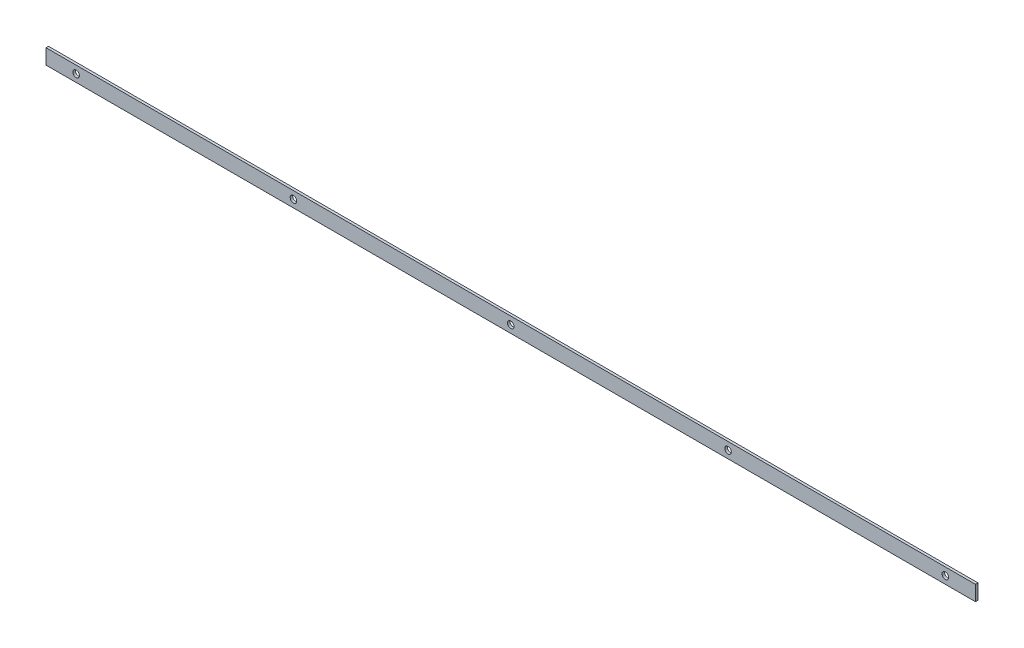
ISO-10303-21;
HEADER;
FILE_DESCRIPTION(('STEP AP214'),'2;1');
FILE_NAME('part.step','',(''),(''),'','','');
FILE_SCHEMA(('AUTOMOTIVE_DESIGN { 1 0 10303 214 1 1 1 1 }'));
ENDSEC;
DATA;
#1=APPLICATION_CONTEXT('core data for automotive mechanical design processes');
#2=APPLICATION_PROTOCOL_DEFINITION('international standard','automotive_design',2000,#1);
#3=PRODUCT_CONTEXT('',#1,'mechanical');
#4=PRODUCT('Part','Part','',(#3));
#5=PRODUCT_RELATED_PRODUCT_CATEGORY('part','',(#4));
#6=PRODUCT_DEFINITION_FORMATION('','',#4);
#7=PRODUCT_DEFINITION_CONTEXT('part definition',#1,'design');
#8=PRODUCT_DEFINITION('design','',#6,#7);
#9=PRODUCT_DEFINITION_SHAPE('','',#8);
#10=(LENGTH_UNIT() NAMED_UNIT(*) SI_UNIT(.MILLI.,.METRE.));
#11=(NAMED_UNIT(*) PLANE_ANGLE_UNIT() SI_UNIT($,.RADIAN.));
#12=(NAMED_UNIT(*) SI_UNIT($,.STERADIAN.) SOLID_ANGLE_UNIT());
#13=UNCERTAINTY_MEASURE_WITH_UNIT(LENGTH_MEASURE(1.E-05),#10,'distance_accuracy_value','');
#14=(GEOMETRIC_REPRESENTATION_CONTEXT(3) GLOBAL_UNCERTAINTY_ASSIGNED_CONTEXT((#13)) GLOBAL_UNIT_ASSIGNED_CONTEXT((#10,
#11,#12)) REPRESENTATION_CONTEXT('',''));
#15=CARTESIAN_POINT('',(0.,0.,0.));
#16=DIRECTION('',(0.,0.,1.));
#17=DIRECTION('',(1.,0.,0.));
#18=AXIS2_PLACEMENT_3D('',#15,#16,#17);
#19=CARTESIAN_POINT('',(865.,0.,-2.5));
#20=DIRECTION('',(0.,0.,-1.));
#21=DIRECTION('',(-1.,0.,0.));
#22=AXIS2_PLACEMENT_3D('',#19,#20,#21);
#23=CYLINDRICAL_SURFACE('',#22,6.49999999999995);
#24=CARTESIAN_POINT('',(865.,0.,2.5));
#25=DIRECTION('',(0.,0.,-1.));
#26=DIRECTION('',(-1.,0.,0.));
#27=AXIS2_PLACEMENT_3D('',#24,#25,#26);
#28=CIRCLE('',#27,6.49999999999995);
#29=CARTESIAN_POINT('',(858.5,0.,2.5));
#30=VERTEX_POINT('',#29);
#31=EDGE_CURVE('E57',#30,#30,#28,.T.);
#32=ORIENTED_EDGE('',*,*,#31,.F.);
#33=EDGE_LOOP('',(#32));
#34=FACE_BOUND('',#33,.T.);
#35=CARTESIAN_POINT('',(865.,0.,-2.5));
#36=DIRECTION('',(0.,0.,-1.));
#37=DIRECTION('',(-1.,0.,0.));
#38=AXIS2_PLACEMENT_3D('',#35,#36,#37);
#39=CIRCLE('',#38,6.49999999999995);
#40=CARTESIAN_POINT('',(858.5,0.,-2.5));
#41=VERTEX_POINT('',#40);
#42=EDGE_CURVE('E12',#41,#41,#39,.T.);
#43=ORIENTED_EDGE('',*,*,#42,.T.);
#44=EDGE_LOOP('',(#43));
#45=FACE_BOUND('',#44,.T.);
#46=ADVANCED_FACE('F49',(#34,#45),#23,.F.);
#47=CARTESIAN_POINT('',(432.5,0.,-2.5));
#48=DIRECTION('',(0.,0.,-1.));
#49=DIRECTION('',(-1.,0.,0.));
#50=AXIS2_PLACEMENT_3D('',#47,#48,#49);
#51=CYLINDRICAL_SURFACE('',#50,6.49999999999995);
#52=CARTESIAN_POINT('',(432.5,0.,2.5));
#53=DIRECTION('',(0.,0.,-1.));
#54=DIRECTION('',(-1.,0.,0.));
#55=AXIS2_PLACEMENT_3D('',#52,#53,#54);
#56=CIRCLE('',#55,6.49999999999995);
#57=CARTESIAN_POINT('',(426.,0.,2.5));
#58=VERTEX_POINT('',#57);
#59=EDGE_CURVE('E133',#58,#58,#56,.T.);
#60=ORIENTED_EDGE('',*,*,#59,.F.);
#61=EDGE_LOOP('',(#60));
#62=FACE_BOUND('',#61,.T.);
#63=CARTESIAN_POINT('',(432.5,0.,-2.5));
#64=DIRECTION('',(0.,0.,-1.));
#65=DIRECTION('',(-1.,0.,0.));
#66=AXIS2_PLACEMENT_3D('',#63,#64,#65);
#67=CIRCLE('',#66,6.49999999999995);
#68=CARTESIAN_POINT('',(426.,0.,-2.5));
#69=VERTEX_POINT('',#68);
#70=EDGE_CURVE('E136',#69,#69,#67,.T.);
#71=ORIENTED_EDGE('',*,*,#70,.T.);
#72=EDGE_LOOP('',(#71));
#73=FACE_BOUND('',#72,.T.);
#74=ADVANCED_FACE('F145',(#62,#73),#51,.F.);
#75=CARTESIAN_POINT('',(0.,0.,-2.5));
#76=DIRECTION('',(0.,0.,-1.));
#77=DIRECTION('',(-1.,0.,0.));
#78=AXIS2_PLACEMENT_3D('',#75,#76,#77);
#79=CYLINDRICAL_SURFACE('',#78,6.49999999999995);
#80=CARTESIAN_POINT('',(0.,0.,2.5));
#81=DIRECTION('',(0.,0.,-1.));
#82=DIRECTION('',(-1.,0.,0.));
#83=AXIS2_PLACEMENT_3D('',#80,#81,#82);
#84=CIRCLE('',#83,6.49999999999995);
#85=CARTESIAN_POINT('',(-6.49999999999995,0.,2.5));
#86=VERTEX_POINT('',#85);
#87=EDGE_CURVE('E127',#86,#86,#84,.T.);
#88=ORIENTED_EDGE('',*,*,#87,.F.);
#89=EDGE_LOOP('',(#88));
#90=FACE_BOUND('',#89,.T.);
#91=CARTESIAN_POINT('',(0.,0.,-2.5));
#92=DIRECTION('',(0.,0.,-1.));
#93=DIRECTION('',(-1.,0.,0.));
#94=AXIS2_PLACEMENT_3D('',#91,#92,#93);
#95=CIRCLE('',#94,6.49999999999995);
#96=CARTESIAN_POINT('',(-6.49999999999995,0.,-2.5));
#97=VERTEX_POINT('',#96);
#98=EDGE_CURVE('E130',#97,#97,#95,.T.);
#99=ORIENTED_EDGE('',*,*,#98,.T.);
#100=EDGE_LOOP('',(#99));
#101=FACE_BOUND('',#100,.T.);
#102=ADVANCED_FACE('F157',(#90,#101),#79,.F.);
#103=CARTESIAN_POINT('',(925.,-15.,2.5));
#104=DIRECTION('',(0.,1.,0.));
#105=DIRECTION('',(0.,0.,1.));
#106=AXIS2_PLACEMENT_3D('',#103,#104,#105);
#107=PLANE('',#106);
#108=DIRECTION('',(0.,0.,-1.));
#109=VECTOR('',#108,1.);
#110=CARTESIAN_POINT('',(-925.,-15.,2.5));
#111=LINE('',#110,#109);
#112=CARTESIAN_POINT('',(-925.,-15.,2.5));
#113=VERTEX_POINT('',#112);
#114=CARTESIAN_POINT('',(-925.,-15.,-2.5));
#115=VERTEX_POINT('',#114);
#116=EDGE_CURVE('E117',#113,#115,#111,.T.);
#117=ORIENTED_EDGE('',*,*,#116,.T.);
#118=DIRECTION('',(-1.,0.,0.));
#119=VECTOR('',#118,1.);
#120=CARTESIAN_POINT('',(925.,-15.,-2.5));
#121=LINE('',#120,#119);
#122=CARTESIAN_POINT('',(925.,-15.,-2.5));
#123=VERTEX_POINT('',#122);
#124=EDGE_CURVE('E108',#123,#115,#121,.T.);
#125=ORIENTED_EDGE('',*,*,#124,.F.);
#126=DIRECTION('',(0.,0.,-1.));
#127=VECTOR('',#126,1.);
#128=CARTESIAN_POINT('',(925.,-15.,2.5));
#129=LINE('',#128,#127);
#130=CARTESIAN_POINT('',(925.,-15.,2.5));
#131=VERTEX_POINT('',#130);
#132=EDGE_CURVE('E101',#131,#123,#129,.T.);
#133=ORIENTED_EDGE('',*,*,#132,.F.);
#134=DIRECTION('',(-1.,0.,0.));
#135=VECTOR('',#134,1.);
#136=CARTESIAN_POINT('',(925.,-15.,2.5));
#137=LINE('',#136,#135);
#138=EDGE_CURVE('E113',#131,#113,#137,.T.);
#139=ORIENTED_EDGE('',*,*,#138,.T.);
#140=EDGE_LOOP('',(#117,#125,#133,#139));
#141=FACE_BOUND('',#140,.T.);
#142=ADVANCED_FACE('F149',(#141),#107,.F.);
#143=CARTESIAN_POINT('',(925.,-15.,-2.5));
#144=DIRECTION('',(0.,0.,1.));
#145=DIRECTION('',(1.,0.,0.));
#146=AXIS2_PLACEMENT_3D('',#143,#144,#145);
#147=PLANE('',#146);
#148=CARTESIAN_POINT('',(-432.5,0.,-2.5));
#149=DIRECTION('',(0.,0.,-1.));
#150=DIRECTION('',(-1.,0.,0.));
#151=AXIS2_PLACEMENT_3D('',#148,#149,#150);
#152=CIRCLE('',#151,6.49999999999995);
#153=CARTESIAN_POINT('',(-439.,0.,-2.5));
#154=VERTEX_POINT('',#153);
#155=EDGE_CURVE('E201',#154,#154,#152,.T.);
#156=ORIENTED_EDGE('',*,*,#155,.F.);
#157=EDGE_LOOP('',(#156));
#158=FACE_BOUND('',#157,.T.);
#159=CARTESIAN_POINT('',(-865.,0.,-2.5));
#160=DIRECTION('',(0.,0.,-1.));
#161=DIRECTION('',(-1.,0.,0.));
#162=AXIS2_PLACEMENT_3D('',#159,#160,#161);
#163=CIRCLE('',#162,6.49999999999995);
#164=CARTESIAN_POINT('',(-871.5,0.,-2.5));
#165=VERTEX_POINT('',#164);
#166=EDGE_CURVE('E202',#165,#165,#163,.T.);
#167=ORIENTED_EDGE('',*,*,#166,.F.);
#168=EDGE_LOOP('',(#167));
#169=FACE_BOUND('',#168,.T.);
#170=DIRECTION('',(0.,1.,0.));
#171=VECTOR('',#170,1.);
#172=CARTESIAN_POINT('',(-925.,-15.,-2.5));
#173=LINE('',#172,#171);
#174=CARTESIAN_POINT('',(-925.,15.,-2.5));
#175=VERTEX_POINT('',#174);
#176=EDGE_CURVE('E107',#115,#175,#173,.T.);
#177=ORIENTED_EDGE('',*,*,#176,.T.);
#178=DIRECTION('',(-1.,0.,0.));
#179=VECTOR('',#178,1.);
#180=CARTESIAN_POINT('',(925.,15.,-2.5));
#181=LINE('',#180,#179);
#182=CARTESIAN_POINT('',(925.,15.,-2.5));
#183=VERTEX_POINT('',#182);
#184=EDGE_CURVE('E104',#183,#175,#181,.T.);
#185=ORIENTED_EDGE('',*,*,#184,.F.);
#186=DIRECTION('',(0.,1.,0.));
#187=VECTOR('',#186,1.);
#188=CARTESIAN_POINT('',(925.,-15.,-2.5));
#189=LINE('',#188,#187);
#190=EDGE_CURVE('E96',#123,#183,#189,.T.);
#191=ORIENTED_EDGE('',*,*,#190,.F.);
#192=ORIENTED_EDGE('',*,*,#124,.T.);
#193=EDGE_LOOP('',(#177,#185,#191,#192));
#194=FACE_BOUND('',#193,.T.);
#195=ORIENTED_EDGE('',*,*,#98,.F.);
#196=EDGE_LOOP('',(#195));
#197=FACE_BOUND('',#196,.T.);
#198=ORIENTED_EDGE('',*,*,#70,.F.);
#199=EDGE_LOOP('',(#198));
#200=FACE_BOUND('',#199,.T.);
#201=ORIENTED_EDGE('',*,*,#42,.F.);
#202=EDGE_LOOP('',(#201));
#203=FACE_BOUND('',#202,.T.);
#204=ADVANCED_FACE('F105',(#158,#169,#194,#197,#200,#203),#147,.F.);
#205=CARTESIAN_POINT('',(925.,15.,2.5));
#206=DIRECTION('',(0.,-1.,0.));
#207=DIRECTION('',(0.,0.,-1.));
#208=AXIS2_PLACEMENT_3D('',#205,#206,#207);
#209=PLANE('',#208);
#210=DIRECTION('',(0.,0.,1.));
#211=VECTOR('',#210,1.);
#212=CARTESIAN_POINT('',(-925.,15.,2.5));
#213=LINE('',#212,#211);
#214=CARTESIAN_POINT('',(-925.,15.,2.5));
#215=VERTEX_POINT('',#214);
#216=EDGE_CURVE('E82',#175,#215,#213,.T.);
#217=ORIENTED_EDGE('',*,*,#216,.T.);
#218=DIRECTION('',(-1.,0.,0.));
#219=VECTOR('',#218,1.);
#220=CARTESIAN_POINT('',(925.,15.,2.5));
#221=LINE('',#220,#219);
#222=CARTESIAN_POINT('',(925.,15.,2.5));
#223=VERTEX_POINT('',#222);
#224=EDGE_CURVE('E109',#223,#215,#221,.T.);
#225=ORIENTED_EDGE('',*,*,#224,.F.);
#226=DIRECTION('',(0.,0.,1.));
#227=VECTOR('',#226,1.);
#228=CARTESIAN_POINT('',(925.,15.,2.5));
#229=LINE('',#228,#227);
#230=EDGE_CURVE('E99',#183,#223,#229,.T.);
#231=ORIENTED_EDGE('',*,*,#230,.F.);
#232=ORIENTED_EDGE('',*,*,#184,.T.);
#233=EDGE_LOOP('',(#217,#225,#231,#232));
#234=FACE_BOUND('',#233,.T.);
#235=ADVANCED_FACE('F111',(#234),#209,.F.);
#236=CARTESIAN_POINT('',(925.,-15.,2.5));
#237=DIRECTION('',(0.,0.,-1.));
#238=DIRECTION('',(-1.,0.,0.));
#239=AXIS2_PLACEMENT_3D('',#236,#237,#238);
#240=PLANE('',#239);
#241=CARTESIAN_POINT('',(-432.5,0.,2.5));
#242=DIRECTION('',(0.,0.,-1.));
#243=DIRECTION('',(-1.,0.,0.));
#244=AXIS2_PLACEMENT_3D('',#241,#242,#243);
#245=CIRCLE('',#244,6.49999999999995);
#246=CARTESIAN_POINT('',(-439.,0.,2.5));
#247=VERTEX_POINT('',#246);
#248=EDGE_CURVE('E199',#247,#247,#245,.T.);
#249=ORIENTED_EDGE('',*,*,#248,.T.);
#250=EDGE_LOOP('',(#249));
#251=FACE_BOUND('',#250,.T.);
#252=CARTESIAN_POINT('',(-865.,0.,2.5));
#253=DIRECTION('',(0.,0.,-1.));
#254=DIRECTION('',(-1.,0.,0.));
#255=AXIS2_PLACEMENT_3D('',#252,#253,#254);
#256=CIRCLE('',#255,6.49999999999995);
#257=CARTESIAN_POINT('',(-871.5,0.,2.5));
#258=VERTEX_POINT('',#257);
#259=EDGE_CURVE('E120',#258,#258,#256,.T.);
#260=ORIENTED_EDGE('',*,*,#259,.T.);
#261=EDGE_LOOP('',(#260));
#262=FACE_BOUND('',#261,.T.);
#263=DIRECTION('',(0.,-1.,0.));
#264=VECTOR('',#263,1.);
#265=CARTESIAN_POINT('',(-925.,-15.,2.5));
#266=LINE('',#265,#264);
#267=EDGE_CURVE('E88',#215,#113,#266,.T.);
#268=ORIENTED_EDGE('',*,*,#267,.T.);
#269=ORIENTED_EDGE('',*,*,#138,.F.);
#270=DIRECTION('',(0.,-1.,0.));
#271=VECTOR('',#270,1.);
#272=CARTESIAN_POINT('',(925.,-15.,2.5));
#273=LINE('',#272,#271);
#274=EDGE_CURVE('E65',#223,#131,#273,.T.);
#275=ORIENTED_EDGE('',*,*,#274,.F.);
#276=ORIENTED_EDGE('',*,*,#224,.T.);
#277=EDGE_LOOP('',(#268,#269,#275,#276));
#278=FACE_BOUND('',#277,.T.);
#279=ORIENTED_EDGE('',*,*,#87,.T.);
#280=EDGE_LOOP('',(#279));
#281=FACE_BOUND('',#280,.T.);
#282=ORIENTED_EDGE('',*,*,#59,.T.);
#283=EDGE_LOOP('',(#282));
#284=FACE_BOUND('',#283,.T.);
#285=ORIENTED_EDGE('',*,*,#31,.T.);
#286=EDGE_LOOP('',(#285));
#287=FACE_BOUND('',#286,.T.);
#288=ADVANCED_FACE('F141',(#251,#262,#278,#281,#284,#287),#240,.F.);
#289=CARTESIAN_POINT('',(925.,-15.,-2.5));
#290=DIRECTION('',(1.,0.,0.));
#291=DIRECTION('',(0.,0.,-1.));
#292=AXIS2_PLACEMENT_3D('',#289,#290,#291);
#293=PLANE('',#292);
#294=ORIENTED_EDGE('',*,*,#132,.T.);
#295=ORIENTED_EDGE('',*,*,#190,.T.);
#296=ORIENTED_EDGE('',*,*,#230,.T.);
#297=ORIENTED_EDGE('',*,*,#274,.T.);
#298=EDGE_LOOP('',(#294,#295,#296,#297));
#299=FACE_BOUND('',#298,.T.);
#300=ADVANCED_FACE('F97',(#299),#293,.T.);
#301=CARTESIAN_POINT('',(-925.,-15.,-2.5));
#302=DIRECTION('',(1.,0.,0.));
#303=DIRECTION('',(0.,0.,-1.));
#304=AXIS2_PLACEMENT_3D('',#301,#302,#303);
#305=PLANE('',#304);
#306=ORIENTED_EDGE('',*,*,#116,.F.);
#307=ORIENTED_EDGE('',*,*,#267,.F.);
#308=ORIENTED_EDGE('',*,*,#216,.F.);
#309=ORIENTED_EDGE('',*,*,#176,.F.);
#310=EDGE_LOOP('',(#306,#307,#308,#309));
#311=FACE_BOUND('',#310,.T.);
#312=ADVANCED_FACE('F180',(#311),#305,.F.);
#313=CARTESIAN_POINT('',(-865.,0.,-2.5));
#314=DIRECTION('',(0.,0.,-1.));
#315=DIRECTION('',(-1.,0.,0.));
#316=AXIS2_PLACEMENT_3D('',#313,#314,#315);
#317=CYLINDRICAL_SURFACE('',#316,6.49999999999995);
#318=ORIENTED_EDGE('',*,*,#259,.F.);
#319=EDGE_LOOP('',(#318));
#320=FACE_BOUND('',#319,.T.);
#321=ORIENTED_EDGE('',*,*,#166,.T.);
#322=EDGE_LOOP('',(#321));
#323=FACE_BOUND('',#322,.T.);
#324=ADVANCED_FACE('F186',(#320,#323),#317,.F.);
#325=CARTESIAN_POINT('',(-432.5,0.,-2.5));
#326=DIRECTION('',(0.,0.,-1.));
#327=DIRECTION('',(-1.,0.,0.));
#328=AXIS2_PLACEMENT_3D('',#325,#326,#327);
#329=CYLINDRICAL_SURFACE('',#328,6.49999999999995);
#330=ORIENTED_EDGE('',*,*,#248,.F.);
#331=EDGE_LOOP('',(#330));
#332=FACE_BOUND('',#331,.T.);
#333=ORIENTED_EDGE('',*,*,#155,.T.);
#334=EDGE_LOOP('',(#333));
#335=FACE_BOUND('',#334,.T.);
#336=ADVANCED_FACE('F191',(#332,#335),#329,.F.);
#337=CLOSED_SHELL('',(#46,#74,#102,#142,#204,#235,#288,#300,#312,#324,#336));
#338=MANIFOLD_SOLID_BREP('B2',#337);
#339=ADVANCED_BREP_SHAPE_REPRESENTATION('',(#18,#338),#14);
#340=SHAPE_DEFINITION_REPRESENTATION(#9,#339);
ENDSEC;
END-ISO-10303-21;
